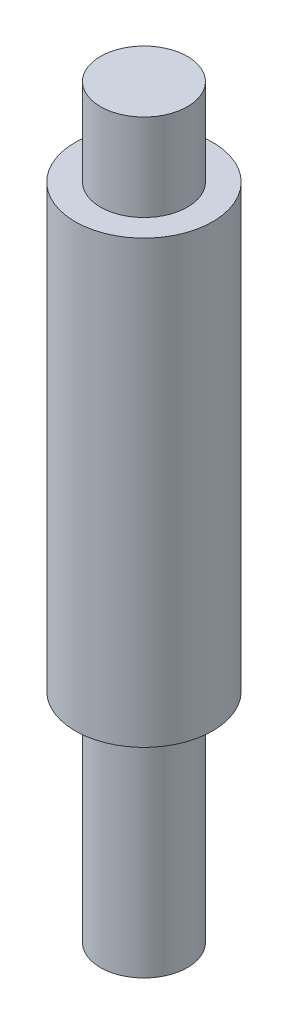
ISO-10303-21;
HEADER;
FILE_DESCRIPTION(('STEP AP214'),'2;1');
FILE_NAME('part.step','',(''),(''),'','','');
FILE_SCHEMA(('AUTOMOTIVE_DESIGN { 1 0 10303 214 1 1 1 1 }'));
ENDSEC;
DATA;
#1=APPLICATION_CONTEXT('core data for automotive mechanical design processes');
#2=APPLICATION_PROTOCOL_DEFINITION('international standard','automotive_design',2000,#1);
#3=PRODUCT_CONTEXT('',#1,'mechanical');
#4=PRODUCT('Part','Part','',(#3));
#5=PRODUCT_RELATED_PRODUCT_CATEGORY('part','',(#4));
#6=PRODUCT_DEFINITION_FORMATION('','',#4);
#7=PRODUCT_DEFINITION_CONTEXT('part definition',#1,'design');
#8=PRODUCT_DEFINITION('design','',#6,#7);
#9=PRODUCT_DEFINITION_SHAPE('','',#8);
#10=(LENGTH_UNIT() NAMED_UNIT(*) SI_UNIT(.MILLI.,.METRE.));
#11=(NAMED_UNIT(*) PLANE_ANGLE_UNIT() SI_UNIT($,.RADIAN.));
#12=(NAMED_UNIT(*) SI_UNIT($,.STERADIAN.) SOLID_ANGLE_UNIT());
#13=UNCERTAINTY_MEASURE_WITH_UNIT(LENGTH_MEASURE(1.E-05),#10,'distance_accuracy_value','');
#14=(GEOMETRIC_REPRESENTATION_CONTEXT(3) GLOBAL_UNCERTAINTY_ASSIGNED_CONTEXT((#13)) GLOBAL_UNIT_ASSIGNED_CONTEXT((#10,
#11,#12)) REPRESENTATION_CONTEXT('',''));
#15=CARTESIAN_POINT('',(0.,0.,0.));
#16=DIRECTION('',(0.,0.,1.));
#17=DIRECTION('',(1.,0.,0.));
#18=AXIS2_PLACEMENT_3D('',#15,#16,#17);
#19=CARTESIAN_POINT('',(0.,96.1009,0.));
#20=DIRECTION('',(0.,1.,0.));
#21=DIRECTION('',(0.,0.,1.));
#22=AXIS2_PLACEMENT_3D('',#19,#20,#21);
#23=PLANE('',#22);
#24=CARTESIAN_POINT('',(0.,96.1009,0.));
#25=DIRECTION('',(0.,1.,0.));
#26=DIRECTION('',(0.,0.,1.));
#27=AXIS2_PLACEMENT_3D('',#24,#25,#26);
#28=CIRCLE('',#27,10.033);
#29=CARTESIAN_POINT('',(0.,96.1009,10.033));
#30=VERTEX_POINT('',#29);
#31=EDGE_CURVE('E68',#30,#30,#28,.T.);
#32=ORIENTED_EDGE('',*,*,#31,.T.);
#33=EDGE_LOOP('',(#32));
#34=FACE_BOUND('',#33,.T.);
#35=CARTESIAN_POINT('',(0.,96.1009,0.));
#36=DIRECTION('',(0.,1.,0.));
#37=DIRECTION('',(0.,0.,1.));
#38=AXIS2_PLACEMENT_3D('',#35,#36,#37);
#39=CIRCLE('',#38,6.35);
#40=CARTESIAN_POINT('',(0.,96.1009,6.35));
#41=VERTEX_POINT('',#40);
#42=EDGE_CURVE('E56',#41,#41,#39,.T.);
#43=ORIENTED_EDGE('',*,*,#42,.F.);
#44=EDGE_LOOP('',(#43));
#45=FACE_BOUND('',#44,.T.);
#46=ADVANCED_FACE('F32',(#34,#45),#23,.T.);
#47=CARTESIAN_POINT('',(0.,31.75,0.));
#48=DIRECTION('',(0.,-1.,0.));
#49=DIRECTION('',(0.,0.,-1.));
#50=AXIS2_PLACEMENT_3D('',#47,#48,#49);
#51=CYLINDRICAL_SURFACE('',#50,6.35);
#52=CARTESIAN_POINT('',(0.,31.75,0.));
#53=DIRECTION('',(0.,1.,0.));
#54=DIRECTION('',(0.,0.,1.));
#55=AXIS2_PLACEMENT_3D('',#52,#53,#54);
#56=CIRCLE('',#55,6.35);
#57=CARTESIAN_POINT('',(0.,31.75,6.35));
#58=VERTEX_POINT('',#57);
#59=EDGE_CURVE('E43',#58,#58,#56,.T.);
#60=ORIENTED_EDGE('',*,*,#59,.F.);
#61=EDGE_LOOP('',(#60));
#62=FACE_BOUND('',#61,.T.);
#63=CARTESIAN_POINT('',(0.,0.,0.));
#64=DIRECTION('',(0.,1.,0.));
#65=DIRECTION('',(0.,0.,1.));
#66=AXIS2_PLACEMENT_3D('',#63,#64,#65);
#67=CIRCLE('',#66,6.35);
#68=CARTESIAN_POINT('',(0.,0.,6.35));
#69=VERTEX_POINT('',#68);
#70=EDGE_CURVE('E71',#69,#69,#67,.T.);
#71=ORIENTED_EDGE('',*,*,#70,.T.);
#72=EDGE_LOOP('',(#71));
#73=FACE_BOUND('',#72,.T.);
#74=ADVANCED_FACE('F34',(#62,#73),#51,.T.);
#75=CARTESIAN_POINT('',(0.,0.,0.));
#76=DIRECTION('',(0.,1.,0.));
#77=DIRECTION('',(0.,0.,1.));
#78=AXIS2_PLACEMENT_3D('',#75,#76,#77);
#79=PLANE('',#78);
#80=ORIENTED_EDGE('',*,*,#70,.F.);
#81=EDGE_LOOP('',(#80));
#82=FACE_BOUND('',#81,.T.);
#83=ADVANCED_FACE('F79',(#82),#79,.F.);
#84=CARTESIAN_POINT('',(0.,31.75,0.));
#85=DIRECTION('',(0.,1.,0.));
#86=DIRECTION('',(0.,0.,1.));
#87=AXIS2_PLACEMENT_3D('',#84,#85,#86);
#88=PLANE('',#87);
#89=CARTESIAN_POINT('',(0.,31.75,0.));
#90=DIRECTION('',(0.,1.,0.));
#91=DIRECTION('',(0.,0.,1.));
#92=AXIS2_PLACEMENT_3D('',#89,#90,#91);
#93=CIRCLE('',#92,10.033);
#94=CARTESIAN_POINT('',(0.,31.75,10.033));
#95=VERTEX_POINT('',#94);
#96=EDGE_CURVE('E66',#95,#95,#93,.T.);
#97=ORIENTED_EDGE('',*,*,#96,.F.);
#98=EDGE_LOOP('',(#97));
#99=FACE_BOUND('',#98,.T.);
#100=ORIENTED_EDGE('',*,*,#59,.T.);
#101=EDGE_LOOP('',(#100));
#102=FACE_BOUND('',#101,.T.);
#103=ADVANCED_FACE('F81',(#99,#102),#88,.F.);
#104=CARTESIAN_POINT('',(0.,96.1009,0.));
#105=DIRECTION('',(0.,-1.,0.));
#106=DIRECTION('',(0.,0.,-1.));
#107=AXIS2_PLACEMENT_3D('',#104,#105,#106);
#108=CYLINDRICAL_SURFACE('',#107,10.033);
#109=CARTESIAN_POINT('',(-1.68098956157985,62.550338986221,-9.89117608140412));
#110=CARTESIAN_POINT('',(-1.60657271553811,62.4590385413983,-9.90382219373305));
#111=CARTESIAN_POINT('',(-1.52565884195679,62.3730853642915,-9.91671168355176));
#112=CARTESIAN_POINT('',(-1.35182469516723,62.2141132094107,-9.94189966025673));
#113=CARTESIAN_POINT('',(-1.25890241739654,62.1410963959391,-9.95419804799903));
#114=CARTESIAN_POINT('',(-1.04919206476998,62.0015667237152,-9.97861979125284));
#115=CARTESIAN_POINT('',(-0.930876258103544,61.9372759064239,-9.9904936085905));
#116=CARTESIAN_POINT('',(-0.683956516867857,61.8320099780585,-10.0104231506297));
#117=CARTESIAN_POINT('',(-0.555357784914913,61.7910231604704,-10.0184807920058));
#118=CARTESIAN_POINT('',(-0.30677461578858,61.7380135548849,-10.0289949802801));
#119=CARTESIAN_POINT('',(-0.187378996760888,61.7233207606035,-10.0319662928008));
#120=CARTESIAN_POINT('',(0.0521269572905809,61.7153205660881,-10.0335778789871));
#121=CARTESIAN_POINT('',(0.172236916708325,61.7220027746521,-10.0322202571134));
#122=CARTESIAN_POINT('',(0.401492300046785,61.755210971248,-10.0255773873814));
#123=CARTESIAN_POINT('',(0.510841436483873,61.7804121759578,-10.0205544998093));
#124=CARTESIAN_POINT('',(0.723905101608578,61.8479215202179,-10.0074198608555));
#125=CARTESIAN_POINT('',(0.827619000258213,61.8902315681467,-9.99930776489898));
#126=CARTESIAN_POINT('',(1.03061667631167,61.9919698734233,-9.98046524742161));
#127=CARTESIAN_POINT('',(1.12961517454098,62.0519492713243,-9.96965256677921));
#128=CARTESIAN_POINT('',(1.31723495768754,62.1861371926547,-9.94660412078581));
#129=CARTESIAN_POINT('',(1.40585242165183,62.2603509289836,-9.9343678347299));
#130=CARTESIAN_POINT('',(1.57989853982126,62.4290103979639,-9.90825605877595));
#131=CARTESIAN_POINT('',(1.66406550519783,62.5247510917791,-9.89434126285253));
#132=CARTESIAN_POINT('',(1.81698395591399,62.7279424618416,-9.86740589321763));
#133=CARTESIAN_POINT('',(1.88572841856487,62.8353984397233,-9.85438572874402));
#134=CARTESIAN_POINT('',(2.01347737709229,63.0713932356581,-9.82912508599377));
#135=CARTESIAN_POINT('',(2.07064001684791,63.2009566394291,-9.81711894394412));
#136=CARTESIAN_POINT('',(2.16420045285767,63.4676566021468,-9.79691894228492));
#137=CARTESIAN_POINT('',(2.20059189774072,63.6047954634563,-9.78872624888458));
#138=CARTESIAN_POINT('',(2.25370785472471,63.8920396913775,-9.77664047411515));
#139=CARTESIAN_POINT('',(2.26904321534784,64.0424166233178,-9.77305203762285));
#140=CARTESIAN_POINT('',(2.27536954636445,64.3437173453673,-9.77158069567513));
#141=CARTESIAN_POINT('',(2.26635698797829,64.4946412115788,-9.77369861725042));
#142=CARTESIAN_POINT('',(2.22376675861278,64.7954875439942,-9.78347768369211));
#143=CARTESIAN_POINT('',(2.18976643281507,64.9453474195231,-9.79123417719067));
#144=CARTESIAN_POINT('',(2.09727889081583,65.2370225278178,-9.81145947443893));
#145=CARTESIAN_POINT('',(2.03878818331373,65.3788366103168,-9.8239289500374));
#146=CARTESIAN_POINT('',(1.89907795273219,65.6484493916437,-9.85188278158456));
#147=CARTESIAN_POINT('',(1.8181239123454,65.7763888853334,-9.86733131562128));
#148=CARTESIAN_POINT('',(1.63457022804736,66.0155927217408,-9.89938968679262));
#149=CARTESIAN_POINT('',(1.5319752356816,66.1268606391014,-9.91599927385627));
#150=CARTESIAN_POINT('',(1.31413938056458,66.3217425622544,-9.94713336310016));
#151=CARTESIAN_POINT('',(1.20005175713811,66.4066294764385,-9.96172325138358));
#152=CARTESIAN_POINT('',(0.95751292412811,66.5531702746608,-9.98794518801268));
#153=CARTESIAN_POINT('',(0.829077587390383,66.6148495095842,-9.99958045928619));
#154=CARTESIAN_POINT('',(0.577745161919557,66.7055445514359,-10.0170488303286));
#155=CARTESIAN_POINT('',(0.455958034624425,66.7375374925974,-10.0234014819421));
#156=CARTESIAN_POINT('',(0.208449113656247,66.7785976146899,-10.0315958807542));
#157=CARTESIAN_POINT('',(0.082730205662389,66.7876812276001,-10.0334408611022));
#158=CARTESIAN_POINT('',(-0.156061858533083,66.7826515324275,-10.0324285692648));
#159=CARTESIAN_POINT('',(-0.269188519066153,66.7706848843548,-10.0300064133098));
#160=CARTESIAN_POINT('',(-0.491752612623683,66.7282358350983,-10.0215602236388));
#161=CARTESIAN_POINT('',(-0.601190170708835,66.6977540622453,-10.0155363121525));
#162=CARTESIAN_POINT('',(-0.813467691479852,66.6197347302797,-10.0005347087495));
#163=CARTESIAN_POINT('',(-0.916311401254778,66.5722069610021,-9.99155871251549));
#164=CARTESIAN_POINT('',(-1.11329782362332,66.4620220543198,-9.97153329263236));
#165=CARTESIAN_POINT('',(-1.20743806493139,66.3993606379609,-9.96048328276473));
#166=CARTESIAN_POINT('',(-1.3930063585651,66.2551058944138,-9.93630301190561));
#167=CARTESIAN_POINT('',(-1.48351950892435,66.1723542296421,-9.92307572119429));
#168=CARTESIAN_POINT('',(-1.65101965977777,65.9941584582485,-9.89658674349007));
#169=CARTESIAN_POINT('',(-1.72800048652612,65.8987085931325,-9.88332504358424));
#170=CARTESIAN_POINT('',(-1.87535056762517,65.6862400031366,-9.85648965727647));
#171=CARTESIAN_POINT('',(-1.94398954858063,65.5680027964605,-9.8430500771392));
#172=CARTESIAN_POINT('',(-2.06236604991264,65.32215962391,-9.81893026117433));
#173=CARTESIAN_POINT('',(-2.11209654642575,65.1945501975334,-9.80825105120175));
#174=CARTESIAN_POINT('',(-2.19527581023253,64.9223289388033,-9.78998647611526));
#175=CARTESIAN_POINT('',(-2.22705157818386,64.7771815211897,-9.78272730917118));
#176=CARTESIAN_POINT('',(-2.26717261285576,64.4835116707163,-9.77350711728856));
#177=CARTESIAN_POINT('',(-2.27551303095831,64.3349885458519,-9.77154718873037));
#178=CARTESIAN_POINT('',(-2.26851256209203,64.0338751888743,-9.77317557446857));
#179=CARTESIAN_POINT('',(-2.25242455409669,63.8813026726186,-9.77693893588529));
#180=CARTESIAN_POINT('',(-2.19543970737615,63.5810701478858,-9.78989165883113));
#181=CARTESIAN_POINT('',(-2.15454100599235,63.4334105091202,-9.7990814277455));
#182=CARTESIAN_POINT('',(-2.05200210835082,63.1564593868941,-9.82104511851436));
#183=CARTESIAN_POINT('',(-1.99184364223003,63.026596922183,-9.83355444041284));
#184=CARTESIAN_POINT('',(-1.85126721220391,62.7786761044884,-9.86098426968711));
#185=CARTESIAN_POINT('',(-1.77086690624782,62.6606075878097,-9.87590267145793));
#186=CARTESIAN_POINT('',(-1.68098956157985,62.550338986221,-9.89117608140412));
#187=B_SPLINE_CURVE_WITH_KNOTS('',3,(#109,#110,#111,#112,#113,#114,#115,#116,#117,#118,#119,
#120,#121,#122,#123,#124,#125,#126,#127,#128,#129,#130,#131,#132,#133,#134,#135,#136,#137,#138,
#139,#140,#141,#142,#143,#144,#145,#146,#147,#148,#149,#150,#151,#152,#153,#154,#155,#156,#157,
#158,#159,#160,#161,#162,#163,#164,#165,#166,#167,#168,#169,#170,#171,#172,#173,#174,#175,#176,
#177,#178,#179,#180,#181,#182,#183,#184,#185,#186),.UNSPECIFIED.,.T.,.F.,(4,2,2,2,2,2,2,2,2,2,2,
2,2,2,2,2,2,2,2,2,2,2,2,2,2,2,2,2,2,2,2,2,2,2,2,2,2,2,4),(0.,0.355029748354569,
0.710118838551057,1.11332450803924,1.51632745213124,1.87540525967208,2.2343085323651,
2.56976691534301,2.90526272681356,3.25259180455784,3.60004832487358,3.98318089692071,
4.36648757716572,4.79100568897495,5.2156535395693,5.66715392312586,6.11871974680603,
6.57810465506988,7.03755507465034,7.49179119575113,7.94592978182338,8.37236437528746,
8.79833179161195,9.17446475384034,9.55032785354766,9.89004729268026,10.2297552037077,
10.5692683257168,10.9088775557806,11.2774297432596,11.6461496384812,12.056537915449,
12.4670784892123,12.9113423341289,13.3556980875151,13.8139204102301,14.2721771381668,
14.701339309431,15.1301283909026),.UNSPECIFIED.);
#188=CARTESIAN_POINT('',(-1.68098956157985,62.550338986221,-9.89117608140412));
#189=VERTEX_POINT('',#188);
#190=EDGE_CURVE('E11',#189,#189,#187,.T.);
#191=ORIENTED_EDGE('',*,*,#190,.T.);
#192=EDGE_LOOP('',(#191));
#193=FACE_BOUND('',#192,.T.);
#194=ORIENTED_EDGE('',*,*,#31,.F.);
#195=EDGE_LOOP('',(#194));
#196=FACE_BOUND('',#195,.T.);
#197=ORIENTED_EDGE('',*,*,#96,.T.);
#198=EDGE_LOOP('',(#197));
#199=FACE_BOUND('',#198,.T.);
#200=ADVANCED_FACE('F86',(#193,#196,#199),#108,.T.);
#201=CARTESIAN_POINT('',(0.,108.8009,0.));
#202=DIRECTION('',(0.,-1.,0.));
#203=DIRECTION('',(0.,0.,-1.));
#204=AXIS2_PLACEMENT_3D('',#201,#202,#203);
#205=CYLINDRICAL_SURFACE('',#204,6.35);
#206=CARTESIAN_POINT('',(0.,108.8009,0.));
#207=DIRECTION('',(0.,1.,0.));
#208=DIRECTION('',(0.,0.,1.));
#209=AXIS2_PLACEMENT_3D('',#206,#207,#208);
#210=CIRCLE('',#209,6.35);
#211=CARTESIAN_POINT('',(0.,108.8009,6.35));
#212=VERTEX_POINT('',#211);
#213=EDGE_CURVE('E60',#212,#212,#210,.T.);
#214=ORIENTED_EDGE('',*,*,#213,.F.);
#215=EDGE_LOOP('',(#214));
#216=FACE_BOUND('',#215,.T.);
#217=ORIENTED_EDGE('',*,*,#42,.T.);
#218=EDGE_LOOP('',(#217));
#219=FACE_BOUND('',#218,.T.);
#220=ADVANCED_FACE('F97',(#216,#219),#205,.T.);
#221=CARTESIAN_POINT('',(0.,108.8009,0.));
#222=DIRECTION('',(0.,1.,0.));
#223=DIRECTION('',(0.,0.,1.));
#224=AXIS2_PLACEMENT_3D('',#221,#222,#223);
#225=PLANE('',#224);
#226=ORIENTED_EDGE('',*,*,#213,.T.);
#227=EDGE_LOOP('',(#226));
#228=FACE_BOUND('',#227,.T.);
#229=ADVANCED_FACE('F105',(#228),#225,.T.);
#230=CARTESIAN_POINT('',(0.,64.25184,-10.033));
#231=DIRECTION('',(0.,0.,-1.));
#232=DIRECTION('',(-1.,0.,0.));
#233=AXIS2_PLACEMENT_3D('',#230,#231,#232);
#234=CONICAL_SURFACE('',#233,2.53365,0.785398163397446);
#235=CARTESIAN_POINT('',(0.,64.25184,-9.398));
#236=DIRECTION('',(0.,0.,-1.));
#237=DIRECTION('',(-1.,0.,0.));
#238=AXIS2_PLACEMENT_3D('',#235,#236,#237);
#239=CIRCLE('',#238,1.89865);
#240=CARTESIAN_POINT('',(-1.89865,64.25184,-9.398));
#241=VERTEX_POINT('',#240);
#242=EDGE_CURVE('E57',#241,#241,#239,.T.);
#243=ORIENTED_EDGE('',*,*,#242,.F.);
#244=EDGE_LOOP('',(#243));
#245=FACE_BOUND('',#244,.T.);
#246=ORIENTED_EDGE('',*,*,#190,.F.);
#247=EDGE_LOOP('',(#246));
#248=FACE_BOUND('',#247,.T.);
#249=ADVANCED_FACE('F50',(#245,#248),#234,.F.);
#250=CARTESIAN_POINT('',(0.,64.25184,0.127));
#251=DIRECTION('',(0.,0.,-1.));
#252=DIRECTION('',(-1.,0.,0.));
#253=AXIS2_PLACEMENT_3D('',#250,#251,#252);
#254=CONICAL_SURFACE('',#253,1.89865,1.02974425867665);
#255=CARTESIAN_POINT('',(0.,64.25184,1.26782401431668));
#256=VERTEX_POINT('',#255);
#257=VERTEX_LOOP('',#256);
#258=FACE_BOUND('',#257,.T.);
#259=CARTESIAN_POINT('',(0.,64.25184,0.127));
#260=DIRECTION('',(0.,0.,-1.));
#261=DIRECTION('',(-1.,0.,0.));
#262=AXIS2_PLACEMENT_3D('',#259,#260,#261);
#263=CIRCLE('',#262,1.89865);
#264=CARTESIAN_POINT('',(-1.89865,64.25184,0.127));
#265=VERTEX_POINT('',#264);
#266=EDGE_CURVE('E54',#265,#265,#263,.T.);
#267=ORIENTED_EDGE('',*,*,#266,.T.);
#268=EDGE_LOOP('',(#267));
#269=FACE_BOUND('',#268,.T.);
#270=ADVANCED_FACE('F46',(#258,#269),#254,.F.);
#271=CARTESIAN_POINT('',(0.,64.25184,-10.033));
#272=DIRECTION('',(0.,0.,-1.));
#273=DIRECTION('',(-1.,0.,0.));
#274=AXIS2_PLACEMENT_3D('',#271,#272,#273);
#275=CYLINDRICAL_SURFACE('',#274,1.89865);
#276=ORIENTED_EDGE('',*,*,#266,.F.);
#277=EDGE_LOOP('',(#276));
#278=FACE_BOUND('',#277,.T.);
#279=ORIENTED_EDGE('',*,*,#242,.T.);
#280=EDGE_LOOP('',(#279));
#281=FACE_BOUND('',#280,.T.);
#282=ADVANCED_FACE('F49',(#278,#281),#275,.F.);
#283=CLOSED_SHELL('',(#46,#74,#83,#103,#200,#220,#229,#249,#270,#282));
#284=MANIFOLD_SOLID_BREP('B2',#283);
#285=ADVANCED_BREP_SHAPE_REPRESENTATION('',(#18,#284),#14);
#286=SHAPE_DEFINITION_REPRESENTATION(#9,#285);
ENDSEC;
END-ISO-10303-21;
